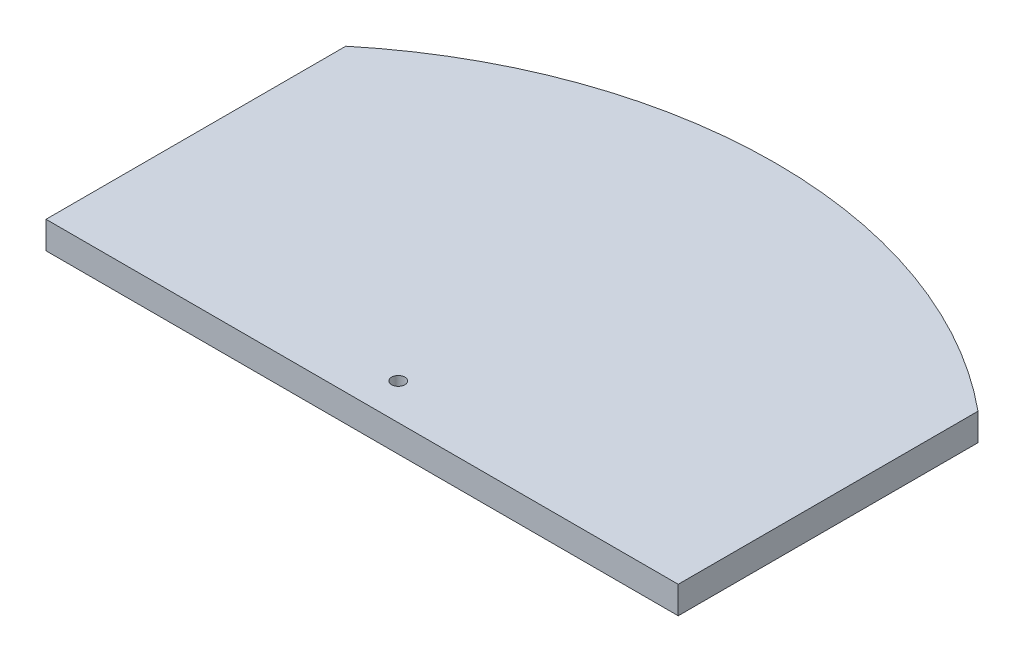
ISO-10303-21;
HEADER;
FILE_DESCRIPTION(('STEP AP214'),'2;1');
FILE_NAME('part.step','',(''),(''),'','','');
FILE_SCHEMA(('AUTOMOTIVE_DESIGN { 1 0 10303 214 1 1 1 1 }'));
ENDSEC;
DATA;
#1=APPLICATION_CONTEXT('core data for automotive mechanical design processes');
#2=APPLICATION_PROTOCOL_DEFINITION('international standard','automotive_design',2000,#1);
#3=PRODUCT_CONTEXT('',#1,'mechanical');
#4=PRODUCT('Part','Part','',(#3));
#5=PRODUCT_RELATED_PRODUCT_CATEGORY('part','',(#4));
#6=PRODUCT_DEFINITION_FORMATION('','',#4);
#7=PRODUCT_DEFINITION_CONTEXT('part definition',#1,'design');
#8=PRODUCT_DEFINITION('design','',#6,#7);
#9=PRODUCT_DEFINITION_SHAPE('','',#8);
#10=(LENGTH_UNIT() NAMED_UNIT(*) SI_UNIT(.MILLI.,.METRE.));
#11=(NAMED_UNIT(*) PLANE_ANGLE_UNIT() SI_UNIT($,.RADIAN.));
#12=(NAMED_UNIT(*) SI_UNIT($,.STERADIAN.) SOLID_ANGLE_UNIT());
#13=UNCERTAINTY_MEASURE_WITH_UNIT(LENGTH_MEASURE(1.E-05),#10,'distance_accuracy_value','');
#14=(GEOMETRIC_REPRESENTATION_CONTEXT(3) GLOBAL_UNCERTAINTY_ASSIGNED_CONTEXT((#13)) GLOBAL_UNIT_ASSIGNED_CONTEXT((#10,
#11,#12)) REPRESENTATION_CONTEXT('',''));
#15=CARTESIAN_POINT('',(0.,0.,0.));
#16=DIRECTION('',(0.,0.,1.));
#17=DIRECTION('',(1.,0.,0.));
#18=AXIS2_PLACEMENT_3D('',#15,#16,#17);
#19=CARTESIAN_POINT('',(0.,4.1,89.1200773529188));
#20=DIRECTION('',(0.,-1.,0.));
#21=DIRECTION('',(0.,0.,-1.));
#22=AXIS2_PLACEMENT_3D('',#19,#20,#21);
#23=PLANE('',#22);
#24=CARTESIAN_POINT('',(0.,4.1,89.1200773529188));
#25=DIRECTION('',(0.,1.,0.));
#26=DIRECTION('',(0.,0.,-1.));
#27=AXIS2_PLACEMENT_3D('',#24,#25,#26);
#28=CIRCLE('',#27,74.5);
#29=CARTESIAN_POINT('',(47.45,4.1,31.6853535353535));
#30=VERTEX_POINT('',#29);
#31=CARTESIAN_POINT('',(-47.45,4.1,31.6853535353535));
#32=VERTEX_POINT('',#31);
#33=EDGE_CURVE('E97',#30,#32,#28,.T.);
#34=ORIENTED_EDGE('',*,*,#33,.T.);
#35=DIRECTION('',(0.,0.,1.));
#36=VECTOR('',#35,1.);
#37=CARTESIAN_POINT('',(-47.45,4.1,31.6853535353535));
#38=LINE('',#37,#36);
#39=CARTESIAN_POINT('',(-47.45,4.1,76.6853535353535));
#40=VERTEX_POINT('',#39);
#41=EDGE_CURVE('E92',#32,#40,#38,.T.);
#42=ORIENTED_EDGE('',*,*,#41,.T.);
#43=DIRECTION('',(1.,0.,0.));
#44=VECTOR('',#43,1.);
#45=CARTESIAN_POINT('',(-47.45,4.1,76.6853535353535));
#46=LINE('',#45,#44);
#47=CARTESIAN_POINT('',(47.45,4.1,76.6853535353535));
#48=VERTEX_POINT('',#47);
#49=EDGE_CURVE('E95',#40,#48,#46,.T.);
#50=ORIENTED_EDGE('',*,*,#49,.T.);
#51=DIRECTION('',(0.,0.,-1.));
#52=VECTOR('',#51,1.);
#53=CARTESIAN_POINT('',(47.45,4.1,31.6853535353535));
#54=LINE('',#53,#52);
#55=EDGE_CURVE('E62',#48,#30,#54,.T.);
#56=ORIENTED_EDGE('',*,*,#55,.T.);
#57=EDGE_LOOP('',(#34,#42,#50,#56));
#58=FACE_BOUND('',#57,.T.);
#59=CARTESIAN_POINT('',(0.,4.1,71.260285785023));
#60=DIRECTION('',(0.,1.,0.));
#61=DIRECTION('',(0.,0.,1.));
#62=AXIS2_PLACEMENT_3D('',#59,#60,#61);
#63=CIRCLE('',#62,1.);
#64=CARTESIAN_POINT('',(0.,4.1,72.260285785023));
#65=VERTEX_POINT('',#64);
#66=EDGE_CURVE('E112',#65,#65,#63,.T.);
#67=ORIENTED_EDGE('',*,*,#66,.F.);
#68=EDGE_LOOP('',(#67));
#69=FACE_BOUND('',#68,.T.);
#70=ADVANCED_FACE('F45',(#58,#69),#23,.F.);
#71=CARTESIAN_POINT('',(0.,0.,89.1200773529188));
#72=DIRECTION('',(0.,-1.,0.));
#73=DIRECTION('',(0.,0.,-1.));
#74=AXIS2_PLACEMENT_3D('',#71,#72,#73);
#75=PLANE('',#74);
#76=CARTESIAN_POINT('',(0.,0.,89.1200773529188));
#77=DIRECTION('',(0.,1.,0.));
#78=DIRECTION('',(0.,0.,-1.));
#79=AXIS2_PLACEMENT_3D('',#76,#77,#78);
#80=CIRCLE('',#79,74.5);
#81=CARTESIAN_POINT('',(47.45,0.,31.6853535353535));
#82=VERTEX_POINT('',#81);
#83=CARTESIAN_POINT('',(-47.45,0.,31.6853535353535));
#84=VERTEX_POINT('',#83);
#85=EDGE_CURVE('E109',#82,#84,#80,.T.);
#86=ORIENTED_EDGE('',*,*,#85,.F.);
#87=DIRECTION('',(0.,0.,-1.));
#88=VECTOR('',#87,1.);
#89=CARTESIAN_POINT('',(47.45,0.,31.6853535353535));
#90=LINE('',#89,#88);
#91=CARTESIAN_POINT('',(47.45,0.,76.6853535353535));
#92=VERTEX_POINT('',#91);
#93=EDGE_CURVE('E85',#92,#82,#90,.T.);
#94=ORIENTED_EDGE('',*,*,#93,.F.);
#95=DIRECTION('',(1.,0.,0.));
#96=VECTOR('',#95,1.);
#97=CARTESIAN_POINT('',(-47.45,0.,76.6853535353535));
#98=LINE('',#97,#96);
#99=CARTESIAN_POINT('',(-47.45,0.,76.6853535353535));
#100=VERTEX_POINT('',#99);
#101=EDGE_CURVE('E79',#100,#92,#98,.T.);
#102=ORIENTED_EDGE('',*,*,#101,.F.);
#103=DIRECTION('',(0.,0.,1.));
#104=VECTOR('',#103,1.);
#105=CARTESIAN_POINT('',(-47.45,0.,31.6853535353535));
#106=LINE('',#105,#104);
#107=EDGE_CURVE('E101',#84,#100,#106,.T.);
#108=ORIENTED_EDGE('',*,*,#107,.F.);
#109=EDGE_LOOP('',(#86,#94,#102,#108));
#110=FACE_BOUND('',#109,.T.);
#111=CARTESIAN_POINT('',(0.,0.,71.260285785023));
#112=DIRECTION('',(0.,1.,0.));
#113=DIRECTION('',(0.,0.,1.));
#114=AXIS2_PLACEMENT_3D('',#111,#112,#113);
#115=CIRCLE('',#114,1.);
#116=CARTESIAN_POINT('',(0.,0.,72.260285785023));
#117=VERTEX_POINT('',#116);
#118=EDGE_CURVE('E124',#117,#117,#115,.T.);
#119=ORIENTED_EDGE('',*,*,#118,.T.);
#120=EDGE_LOOP('',(#119));
#121=FACE_BOUND('',#120,.T.);
#122=ADVANCED_FACE('F120',(#110,#121),#75,.T.);
#123=CARTESIAN_POINT('',(0.,4.1,89.1200773529188));
#124=DIRECTION('',(0.,-1.,0.));
#125=DIRECTION('',(0.,0.,-1.));
#126=AXIS2_PLACEMENT_3D('',#123,#124,#125);
#127=CYLINDRICAL_SURFACE('',#126,74.5);
#128=ORIENTED_EDGE('',*,*,#85,.T.);
#129=DIRECTION('',(0.,-1.,0.));
#130=VECTOR('',#129,1.);
#131=CARTESIAN_POINT('',(-47.45,4.1,31.6853535353535));
#132=LINE('',#131,#130);
#133=EDGE_CURVE('E11',#32,#84,#132,.T.);
#134=ORIENTED_EDGE('',*,*,#133,.F.);
#135=ORIENTED_EDGE('',*,*,#33,.F.);
#136=DIRECTION('',(0.,-1.,0.));
#137=VECTOR('',#136,1.);
#138=CARTESIAN_POINT('',(47.45,4.1,31.6853535353535));
#139=LINE('',#138,#137);
#140=EDGE_CURVE('E105',#30,#82,#139,.T.);
#141=ORIENTED_EDGE('',*,*,#140,.T.);
#142=EDGE_LOOP('',(#128,#134,#135,#141));
#143=FACE_BOUND('',#142,.T.);
#144=ADVANCED_FACE('F47',(#143),#127,.T.);
#145=CARTESIAN_POINT('',(-47.45,4.1,31.6853535353535));
#146=DIRECTION('',(1.,0.,0.));
#147=DIRECTION('',(0.,0.,-1.));
#148=AXIS2_PLACEMENT_3D('',#145,#146,#147);
#149=PLANE('',#148);
#150=ORIENTED_EDGE('',*,*,#107,.T.);
#151=DIRECTION('',(0.,-1.,0.));
#152=VECTOR('',#151,1.);
#153=CARTESIAN_POINT('',(-47.45,4.1,76.6853535353535));
#154=LINE('',#153,#152);
#155=EDGE_CURVE('E54',#40,#100,#154,.T.);
#156=ORIENTED_EDGE('',*,*,#155,.F.);
#157=ORIENTED_EDGE('',*,*,#41,.F.);
#158=ORIENTED_EDGE('',*,*,#133,.T.);
#159=EDGE_LOOP('',(#150,#156,#157,#158));
#160=FACE_BOUND('',#159,.T.);
#161=ADVANCED_FACE('F100',(#160),#149,.F.);
#162=CARTESIAN_POINT('',(-47.45,4.1,76.6853535353535));
#163=DIRECTION('',(0.,0.,-1.));
#164=DIRECTION('',(-1.,0.,0.));
#165=AXIS2_PLACEMENT_3D('',#162,#163,#164);
#166=PLANE('',#165);
#167=ORIENTED_EDGE('',*,*,#101,.T.);
#168=DIRECTION('',(0.,-1.,0.));
#169=VECTOR('',#168,1.);
#170=CARTESIAN_POINT('',(47.45,4.1,76.6853535353535));
#171=LINE('',#170,#169);
#172=EDGE_CURVE('E102',#48,#92,#171,.T.);
#173=ORIENTED_EDGE('',*,*,#172,.F.);
#174=ORIENTED_EDGE('',*,*,#49,.F.);
#175=ORIENTED_EDGE('',*,*,#155,.T.);
#176=EDGE_LOOP('',(#167,#173,#174,#175));
#177=FACE_BOUND('',#176,.T.);
#178=ADVANCED_FACE('F103',(#177),#166,.F.);
#179=CARTESIAN_POINT('',(47.45,4.1,31.6853535353535));
#180=DIRECTION('',(-1.,0.,0.));
#181=DIRECTION('',(0.,0.,1.));
#182=AXIS2_PLACEMENT_3D('',#179,#180,#181);
#183=PLANE('',#182);
#184=ORIENTED_EDGE('',*,*,#93,.T.);
#185=ORIENTED_EDGE('',*,*,#140,.F.);
#186=ORIENTED_EDGE('',*,*,#55,.F.);
#187=ORIENTED_EDGE('',*,*,#172,.T.);
#188=EDGE_LOOP('',(#184,#185,#186,#187));
#189=FACE_BOUND('',#188,.T.);
#190=ADVANCED_FACE('F117',(#189),#183,.F.);
#191=CARTESIAN_POINT('',(0.,4.1,71.260285785023));
#192=DIRECTION('',(0.,-1.,0.));
#193=DIRECTION('',(0.,0.,-1.));
#194=AXIS2_PLACEMENT_3D('',#191,#192,#193);
#195=CYLINDRICAL_SURFACE('',#194,1.);
#196=ORIENTED_EDGE('',*,*,#66,.T.);
#197=EDGE_LOOP('',(#196));
#198=FACE_BOUND('',#197,.T.);
#199=ORIENTED_EDGE('',*,*,#118,.F.);
#200=EDGE_LOOP('',(#199));
#201=FACE_BOUND('',#200,.T.);
#202=ADVANCED_FACE('F130',(#198,#201),#195,.F.);
#203=CLOSED_SHELL('',(#70,#122,#144,#161,#178,#190,#202));
#204=MANIFOLD_SOLID_BREP('B2',#203);
#205=ADVANCED_BREP_SHAPE_REPRESENTATION('',(#18,#204),#14);
#206=SHAPE_DEFINITION_REPRESENTATION(#9,#205);
ENDSEC;
END-ISO-10303-21;
